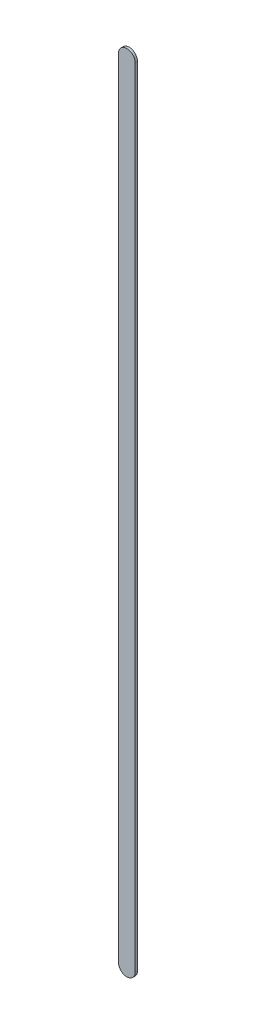
ISO-10303-21;
HEADER;
FILE_DESCRIPTION(('STEP AP214'),'2;1');
FILE_NAME('part.step','',(''),(''),'','','');
FILE_SCHEMA(('AUTOMOTIVE_DESIGN { 1 0 10303 214 1 1 1 1 }'));
ENDSEC;
DATA;
#1=APPLICATION_CONTEXT('core data for automotive mechanical design processes');
#2=APPLICATION_PROTOCOL_DEFINITION('international standard','automotive_design',2000,#1);
#3=PRODUCT_CONTEXT('',#1,'mechanical');
#4=PRODUCT('Part','Part','',(#3));
#5=PRODUCT_RELATED_PRODUCT_CATEGORY('part','',(#4));
#6=PRODUCT_DEFINITION_FORMATION('','',#4);
#7=PRODUCT_DEFINITION_CONTEXT('part definition',#1,'design');
#8=PRODUCT_DEFINITION('design','',#6,#7);
#9=PRODUCT_DEFINITION_SHAPE('','',#8);
#10=(LENGTH_UNIT() NAMED_UNIT(*) SI_UNIT(.MILLI.,.METRE.));
#11=(NAMED_UNIT(*) PLANE_ANGLE_UNIT() SI_UNIT($,.RADIAN.));
#12=(NAMED_UNIT(*) SI_UNIT($,.STERADIAN.) SOLID_ANGLE_UNIT());
#13=UNCERTAINTY_MEASURE_WITH_UNIT(LENGTH_MEASURE(1.E-05),#10,'distance_accuracy_value','');
#14=(GEOMETRIC_REPRESENTATION_CONTEXT(3) GLOBAL_UNCERTAINTY_ASSIGNED_CONTEXT((#13)) GLOBAL_UNIT_ASSIGNED_CONTEXT((#10,
#11,#12)) REPRESENTATION_CONTEXT('',''));
#15=CARTESIAN_POINT('',(0.,0.,0.));
#16=DIRECTION('',(0.,0.,1.));
#17=DIRECTION('',(1.,0.,0.));
#18=AXIS2_PLACEMENT_3D('',#15,#16,#17);
#19=CARTESIAN_POINT('',(79.6439733,82.18697304,0.));
#20=DIRECTION('',(-1.,0.,0.));
#21=DIRECTION('',(0.,1.,0.));
#22=AXIS2_PLACEMENT_3D('',#19,#20,#21);
#23=PLANE('',#22);
#24=DIRECTION('',(0.,1.,0.));
#25=VECTOR('',#24,1.);
#26=CARTESIAN_POINT('',(79.6439733,82.18697304,0.03556));
#27=LINE('',#26,#25);
#28=CARTESIAN_POINT('',(79.6439733,82.18697304,0.03556));
#29=VERTEX_POINT('',#28);
#30=CARTESIAN_POINT('',(79.6439733,94.13818104,0.03556));
#31=VERTEX_POINT('',#30);
#32=EDGE_CURVE('E11',#29,#31,#27,.T.);
#33=ORIENTED_EDGE('',*,*,#32,.F.);
#34=DIRECTION('',(0.,0.,1.));
#35=VECTOR('',#34,1.);
#36=CARTESIAN_POINT('',(79.6439733,82.18697304,0.));
#37=LINE('',#36,#35);
#38=CARTESIAN_POINT('',(79.6439733,82.18697304,0.));
#39=VERTEX_POINT('',#38);
#40=EDGE_CURVE('E24',#39,#29,#37,.T.);
#41=ORIENTED_EDGE('',*,*,#40,.F.);
#42=DIRECTION('',(0.,1.,0.));
#43=VECTOR('',#42,1.);
#44=CARTESIAN_POINT('',(79.6439733,82.18697304,0.));
#45=LINE('',#44,#43);
#46=CARTESIAN_POINT('',(79.6439733,94.13818104,0.));
#47=VERTEX_POINT('',#46);
#48=EDGE_CURVE('E75',#39,#47,#45,.T.);
#49=ORIENTED_EDGE('',*,*,#48,.T.);
#50=DIRECTION('',(0.,0.,1.));
#51=VECTOR('',#50,1.);
#52=CARTESIAN_POINT('',(79.6439733,94.13818104,0.));
#53=LINE('',#52,#51);
#54=EDGE_CURVE('E37',#47,#31,#53,.T.);
#55=ORIENTED_EDGE('',*,*,#54,.T.);
#56=EDGE_LOOP('',(#33,#41,#49,#55));
#57=FACE_BOUND('',#56,.T.);
#58=ADVANCED_FACE('F17',(#57),#23,.F.);
#59=CARTESIAN_POINT('',(79.5169733,94.13818104,0.));
#60=DIRECTION('',(0.,0.,-1.));
#61=DIRECTION('',(1.,-1.1189649382048E-13,0.));
#62=AXIS2_PLACEMENT_3D('',#59,#60,#61);
#63=CYLINDRICAL_SURFACE('',#62,0.127);
#64=CARTESIAN_POINT('',(79.5169733,94.13818104,0.03556));
#65=DIRECTION('',(0.,0.,1.));
#66=DIRECTION('',(1.,-1.1189649382048E-13,0.));
#67=AXIS2_PLACEMENT_3D('',#64,#65,#66);
#68=CIRCLE('',#67,0.127);
#69=CARTESIAN_POINT('',(79.3899733,94.13818104,0.03556));
#70=VERTEX_POINT('',#69);
#71=EDGE_CURVE('E83',#31,#70,#68,.T.);
#72=ORIENTED_EDGE('',*,*,#71,.F.);
#73=ORIENTED_EDGE('',*,*,#54,.F.);
#74=CARTESIAN_POINT('',(79.5169733,94.13818104,0.));
#75=DIRECTION('',(0.,0.,1.));
#76=DIRECTION('',(1.,-1.1189649382048E-13,0.));
#77=AXIS2_PLACEMENT_3D('',#74,#75,#76);
#78=CIRCLE('',#77,0.127);
#79=CARTESIAN_POINT('',(79.3899733,94.13818104,0.));
#80=VERTEX_POINT('',#79);
#81=EDGE_CURVE('E81',#47,#80,#78,.T.);
#82=ORIENTED_EDGE('',*,*,#81,.T.);
#83=DIRECTION('',(0.,0.,1.));
#84=VECTOR('',#83,1.);
#85=CARTESIAN_POINT('',(79.3899733,94.13818104,0.));
#86=LINE('',#85,#84);
#87=EDGE_CURVE('E67',#80,#70,#86,.T.);
#88=ORIENTED_EDGE('',*,*,#87,.T.);
#89=EDGE_LOOP('',(#72,#73,#82,#88));
#90=FACE_BOUND('',#89,.T.);
#91=ADVANCED_FACE('F89',(#90),#63,.T.);
#92=CARTESIAN_POINT('',(79.3899733,94.13818104,0.));
#93=DIRECTION('',(1.,0.,0.));
#94=DIRECTION('',(0.,-1.,0.));
#95=AXIS2_PLACEMENT_3D('',#92,#93,#94);
#96=PLANE('',#95);
#97=DIRECTION('',(0.,-1.,0.));
#98=VECTOR('',#97,1.);
#99=CARTESIAN_POINT('',(79.3899733,94.13818104,0.03556));
#100=LINE('',#99,#98);
#101=CARTESIAN_POINT('',(79.3899733,82.18697304,0.03556));
#102=VERTEX_POINT('',#101);
#103=EDGE_CURVE('E71',#70,#102,#100,.T.);
#104=ORIENTED_EDGE('',*,*,#103,.F.);
#105=ORIENTED_EDGE('',*,*,#87,.F.);
#106=DIRECTION('',(0.,-1.,0.));
#107=VECTOR('',#106,1.);
#108=CARTESIAN_POINT('',(79.3899733,94.13818104,0.));
#109=LINE('',#108,#107);
#110=CARTESIAN_POINT('',(79.3899733,82.18697304,0.));
#111=VERTEX_POINT('',#110);
#112=EDGE_CURVE('E63',#80,#111,#109,.T.);
#113=ORIENTED_EDGE('',*,*,#112,.T.);
#114=DIRECTION('',(0.,0.,1.));
#115=VECTOR('',#114,1.);
#116=CARTESIAN_POINT('',(79.3899733,82.18697304,0.));
#117=LINE('',#116,#115);
#118=EDGE_CURVE('E53',#111,#102,#117,.T.);
#119=ORIENTED_EDGE('',*,*,#118,.T.);
#120=EDGE_LOOP('',(#104,#105,#113,#119));
#121=FACE_BOUND('',#120,.T.);
#122=ADVANCED_FACE('F66',(#121),#96,.F.);
#123=CARTESIAN_POINT('',(79.5169733,82.18697304,0.));
#124=DIRECTION('',(0.,0.,-1.));
#125=DIRECTION('',(-1.,0.,0.));
#126=AXIS2_PLACEMENT_3D('',#123,#124,#125);
#127=CYLINDRICAL_SURFACE('',#126,0.127);
#128=CARTESIAN_POINT('',(79.5169733,82.18697304,0.03556));
#129=DIRECTION('',(0.,0.,1.));
#130=DIRECTION('',(-1.,0.,0.));
#131=AXIS2_PLACEMENT_3D('',#128,#129,#130);
#132=CIRCLE('',#131,0.127);
#133=EDGE_CURVE('E59',#102,#29,#132,.T.);
#134=ORIENTED_EDGE('',*,*,#133,.F.);
#135=ORIENTED_EDGE('',*,*,#118,.F.);
#136=CARTESIAN_POINT('',(79.5169733,82.18697304,0.));
#137=DIRECTION('',(0.,0.,1.));
#138=DIRECTION('',(-1.,0.,0.));
#139=AXIS2_PLACEMENT_3D('',#136,#137,#138);
#140=CIRCLE('',#139,0.127);
#141=EDGE_CURVE('E57',#111,#39,#140,.T.);
#142=ORIENTED_EDGE('',*,*,#141,.T.);
#143=ORIENTED_EDGE('',*,*,#40,.T.);
#144=EDGE_LOOP('',(#134,#135,#142,#143));
#145=FACE_BOUND('',#144,.T.);
#146=ADVANCED_FACE('F55',(#145),#127,.T.);
#147=CARTESIAN_POINT('',(79.6439733,82.18697304,0.));
#148=DIRECTION('',(0.,0.,-1.));
#149=DIRECTION('',(-1.,0.,0.));
#150=AXIS2_PLACEMENT_3D('',#147,#148,#149);
#151=PLANE('',#150);
#152=ORIENTED_EDGE('',*,*,#141,.F.);
#153=ORIENTED_EDGE('',*,*,#112,.F.);
#154=ORIENTED_EDGE('',*,*,#81,.F.);
#155=ORIENTED_EDGE('',*,*,#48,.F.);
#156=EDGE_LOOP('',(#152,#153,#154,#155));
#157=FACE_BOUND('',#156,.T.);
#158=ADVANCED_FACE('F74',(#157),#151,.T.);
#159=CARTESIAN_POINT('',(79.6439733,82.18697304,0.03556));
#160=DIRECTION('',(0.,0.,-1.));
#161=DIRECTION('',(-1.,0.,0.));
#162=AXIS2_PLACEMENT_3D('',#159,#160,#161);
#163=PLANE('',#162);
#164=ORIENTED_EDGE('',*,*,#32,.T.);
#165=ORIENTED_EDGE('',*,*,#71,.T.);
#166=ORIENTED_EDGE('',*,*,#103,.T.);
#167=ORIENTED_EDGE('',*,*,#133,.T.);
#168=EDGE_LOOP('',(#164,#165,#166,#167));
#169=FACE_BOUND('',#168,.T.);
#170=ADVANCED_FACE('F91',(#169),#163,.F.);
#171=CLOSED_SHELL('',(#58,#91,#122,#146,#158,#170));
#172=MANIFOLD_SOLID_BREP('B1',#171);
#173=ADVANCED_BREP_SHAPE_REPRESENTATION('',(#18,#172),#14);
#174=SHAPE_DEFINITION_REPRESENTATION(#9,#173);
ENDSEC;
END-ISO-10303-21;
